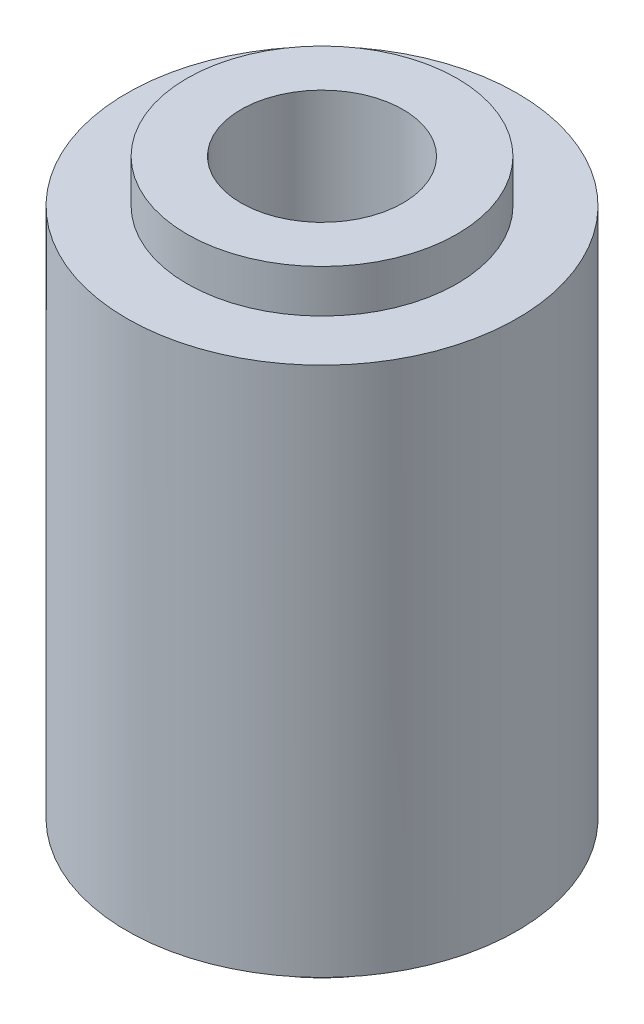
ISO-10303-21;
HEADER;
FILE_DESCRIPTION(('STEP AP214'),'2;1');
FILE_NAME('part.step','',(''),(''),'','','');
FILE_SCHEMA(('AUTOMOTIVE_DESIGN { 1 0 10303 214 1 1 1 1 }'));
ENDSEC;
DATA;
#1=APPLICATION_CONTEXT('core data for automotive mechanical design processes');
#2=APPLICATION_PROTOCOL_DEFINITION('international standard','automotive_design',2000,#1);
#3=PRODUCT_CONTEXT('',#1,'mechanical');
#4=PRODUCT('Part','Part','',(#3));
#5=PRODUCT_RELATED_PRODUCT_CATEGORY('part','',(#4));
#6=PRODUCT_DEFINITION_FORMATION('','',#4);
#7=PRODUCT_DEFINITION_CONTEXT('part definition',#1,'design');
#8=PRODUCT_DEFINITION('design','',#6,#7);
#9=PRODUCT_DEFINITION_SHAPE('','',#8);
#10=(LENGTH_UNIT() NAMED_UNIT(*) SI_UNIT(.MILLI.,.METRE.));
#11=(NAMED_UNIT(*) PLANE_ANGLE_UNIT() SI_UNIT($,.RADIAN.));
#12=(NAMED_UNIT(*) SI_UNIT($,.STERADIAN.) SOLID_ANGLE_UNIT());
#13=UNCERTAINTY_MEASURE_WITH_UNIT(LENGTH_MEASURE(1.E-05),#10,'distance_accuracy_value','');
#14=(GEOMETRIC_REPRESENTATION_CONTEXT(3) GLOBAL_UNCERTAINTY_ASSIGNED_CONTEXT((#13)) GLOBAL_UNIT_ASSIGNED_CONTEXT((#10,
#11,#12)) REPRESENTATION_CONTEXT('',''));
#15=CARTESIAN_POINT('',(0.,0.,0.));
#16=DIRECTION('',(0.,0.,1.));
#17=DIRECTION('',(1.,0.,0.));
#18=AXIS2_PLACEMENT_3D('',#15,#16,#17);
#19=CARTESIAN_POINT('',(0.,5.6,0.));
#20=DIRECTION('',(0.,-1.,0.));
#21=DIRECTION('',(0.,0.,-1.));
#22=AXIS2_PLACEMENT_3D('',#19,#20,#21);
#23=CYLINDRICAL_SURFACE('',#22,3.9751);
#24=CARTESIAN_POINT('',(0.,5.4,0.));
#25=DIRECTION('',(0.,1.,0.));
#26=DIRECTION('',(0.,0.,1.));
#27=AXIS2_PLACEMENT_3D('',#24,#25,#26);
#28=CIRCLE('',#27,3.9751);
#29=CARTESIAN_POINT('',(0.,5.4,3.9751));
#30=VERTEX_POINT('',#29);
#31=EDGE_CURVE('E68',#30,#30,#28,.T.);
#32=ORIENTED_EDGE('',*,*,#31,.F.);
#33=EDGE_LOOP('',(#32));
#34=FACE_BOUND('',#33,.T.);
#35=CARTESIAN_POINT('',(0.,-5.4,0.));
#36=DIRECTION('',(0.,-1.,0.));
#37=DIRECTION('',(0.,0.,-1.));
#38=AXIS2_PLACEMENT_3D('',#35,#36,#37);
#39=CIRCLE('',#38,3.9751);
#40=CARTESIAN_POINT('',(0.,-5.4,-3.9751));
#41=VERTEX_POINT('',#40);
#42=EDGE_CURVE('E76',#41,#41,#39,.T.);
#43=ORIENTED_EDGE('',*,*,#42,.F.);
#44=EDGE_LOOP('',(#43));
#45=FACE_BOUND('',#44,.T.);
#46=ADVANCED_FACE('F45',(#34,#45),#23,.T.);
#47=CARTESIAN_POINT('',(0.,-14.728174593052,0.));
#48=DIRECTION('',(0.,1.,0.));
#49=DIRECTION('',(0.,0.,1.));
#50=AXIS2_PLACEMENT_3D('',#47,#48,#49);
#51=CYLINDRICAL_SURFACE('',#50,2.75);
#52=CARTESIAN_POINT('',(0.,-6.275,0.));
#53=DIRECTION('',(0.,1.,0.));
#54=DIRECTION('',(0.,0.,1.));
#55=AXIS2_PLACEMENT_3D('',#52,#53,#54);
#56=CIRCLE('',#55,2.75);
#57=CARTESIAN_POINT('',(0.,-6.275,2.75));
#58=VERTEX_POINT('',#57);
#59=EDGE_CURVE('E52',#58,#58,#56,.F.);
#60=ORIENTED_EDGE('',*,*,#59,.F.);
#61=EDGE_LOOP('',(#60));
#62=FACE_BOUND('',#61,.T.);
#63=CARTESIAN_POINT('',(0.,-5.4,0.));
#64=DIRECTION('',(0.,-1.,0.));
#65=DIRECTION('',(0.,0.,-1.));
#66=AXIS2_PLACEMENT_3D('',#63,#64,#65);
#67=CIRCLE('',#66,2.75);
#68=CARTESIAN_POINT('',(0.,-5.4,-2.75));
#69=VERTEX_POINT('',#68);
#70=EDGE_CURVE('E80',#69,#69,#67,.T.);
#71=ORIENTED_EDGE('',*,*,#70,.T.);
#72=EDGE_LOOP('',(#71));
#73=FACE_BOUND('',#72,.T.);
#74=ADVANCED_FACE('F85',(#62,#73),#51,.T.);
#75=CARTESIAN_POINT('',(0.,-6.275,0.));
#76=DIRECTION('',(0.,1.,0.));
#77=DIRECTION('',(0.,0.,1.));
#78=AXIS2_PLACEMENT_3D('',#75,#76,#77);
#79=PLANE('',#78);
#80=ORIENTED_EDGE('',*,*,#59,.T.);
#81=EDGE_LOOP('',(#80));
#82=FACE_BOUND('',#81,.T.);
#83=CARTESIAN_POINT('',(0.,-6.275,0.));
#84=DIRECTION('',(0.,1.,0.));
#85=DIRECTION('',(0.,0.,1.));
#86=AXIS2_PLACEMENT_3D('',#83,#84,#85);
#87=CIRCLE('',#86,1.65);
#88=CARTESIAN_POINT('',(0.,-6.275,1.65));
#89=VERTEX_POINT('',#88);
#90=EDGE_CURVE('E11',#89,#89,#87,.F.);
#91=ORIENTED_EDGE('',*,*,#90,.F.);
#92=EDGE_LOOP('',(#91));
#93=FACE_BOUND('',#92,.T.);
#94=ADVANCED_FACE('F100',(#82,#93),#79,.F.);
#95=CARTESIAN_POINT('',(0.,5.6,0.));
#96=DIRECTION('',(0.,1.,0.));
#97=DIRECTION('',(0.,0.,1.));
#98=AXIS2_PLACEMENT_3D('',#95,#96,#97);
#99=CYLINDRICAL_SURFACE('',#98,1.65);
#100=ORIENTED_EDGE('',*,*,#90,.T.);
#101=EDGE_LOOP('',(#100));
#102=FACE_BOUND('',#101,.T.);
#103=CARTESIAN_POINT('',(0.,6.275,0.));
#104=DIRECTION('',(0.,1.,0.));
#105=DIRECTION('',(0.,0.,1.));
#106=AXIS2_PLACEMENT_3D('',#103,#104,#105);
#107=CIRCLE('',#106,1.65);
#108=CARTESIAN_POINT('',(0.,6.275,1.65));
#109=VERTEX_POINT('',#108);
#110=EDGE_CURVE('E62',#109,#109,#107,.T.);
#111=ORIENTED_EDGE('',*,*,#110,.T.);
#112=EDGE_LOOP('',(#111));
#113=FACE_BOUND('',#112,.T.);
#114=ADVANCED_FACE('F118',(#102,#113),#99,.F.);
#115=CARTESIAN_POINT('',(0.,6.275,0.));
#116=DIRECTION('',(0.,1.,0.));
#117=DIRECTION('',(0.,0.,1.));
#118=AXIS2_PLACEMENT_3D('',#115,#116,#117);
#119=CIRCLE('',#118,2.75);
#120=CARTESIAN_POINT('',(0.,6.275,2.75));
#121=VERTEX_POINT('',#120);
#122=EDGE_CURVE('E57',#121,#121,#119,.T.);
#123=ORIENTED_EDGE('',*,*,#122,.F.);
#124=EDGE_LOOP('',(#123));
#125=FACE_BOUND('',#124,.T.);
#126=CARTESIAN_POINT('',(0.,5.4,0.));
#127=DIRECTION('',(0.,1.,0.));
#128=DIRECTION('',(0.,0.,1.));
#129=AXIS2_PLACEMENT_3D('',#126,#127,#128);
#130=CIRCLE('',#129,2.75);
#131=CARTESIAN_POINT('',(0.,5.4,2.75));
#132=VERTEX_POINT('',#131);
#133=EDGE_CURVE('E72',#132,#132,#130,.T.);
#134=ORIENTED_EDGE('',*,*,#133,.T.);
#135=EDGE_LOOP('',(#134));
#136=FACE_BOUND('',#135,.T.);
#137=ADVANCED_FACE('F103',(#125,#136),#51,.T.);
#138=CARTESIAN_POINT('',(0.,6.275,0.));
#139=DIRECTION('',(0.,1.,0.));
#140=DIRECTION('',(0.,0.,1.));
#141=AXIS2_PLACEMENT_3D('',#138,#139,#140);
#142=PLANE('',#141);
#143=ORIENTED_EDGE('',*,*,#122,.T.);
#144=EDGE_LOOP('',(#143));
#145=FACE_BOUND('',#144,.T.);
#146=ORIENTED_EDGE('',*,*,#110,.F.);
#147=EDGE_LOOP('',(#146));
#148=FACE_BOUND('',#147,.T.);
#149=ADVANCED_FACE('F106',(#145,#148),#142,.T.);
#150=CARTESIAN_POINT('',(0.,5.4,0.));
#151=DIRECTION('',(0.,1.,0.));
#152=DIRECTION('',(0.,0.,1.));
#153=AXIS2_PLACEMENT_3D('',#150,#151,#152);
#154=PLANE('',#153);
#155=ORIENTED_EDGE('',*,*,#133,.F.);
#156=EDGE_LOOP('',(#155));
#157=FACE_BOUND('',#156,.T.);
#158=ORIENTED_EDGE('',*,*,#31,.T.);
#159=EDGE_LOOP('',(#158));
#160=FACE_BOUND('',#159,.T.);
#161=ADVANCED_FACE('F90',(#157,#160),#154,.T.);
#162=CARTESIAN_POINT('',(0.,-5.4,0.));
#163=DIRECTION('',(0.,-1.,0.));
#164=DIRECTION('',(0.,0.,-1.));
#165=AXIS2_PLACEMENT_3D('',#162,#163,#164);
#166=PLANE('',#165);
#167=ORIENTED_EDGE('',*,*,#70,.F.);
#168=EDGE_LOOP('',(#167));
#169=FACE_BOUND('',#168,.T.);
#170=ORIENTED_EDGE('',*,*,#42,.T.);
#171=EDGE_LOOP('',(#170));
#172=FACE_BOUND('',#171,.T.);
#173=ADVANCED_FACE('F87',(#169,#172),#166,.T.);
#174=CLOSED_SHELL('',(#46,#74,#94,#114,#137,#149,#161,#173));
#175=MANIFOLD_SOLID_BREP('B2',#174);
#176=ADVANCED_BREP_SHAPE_REPRESENTATION('',(#18,#175),#14);
#177=SHAPE_DEFINITION_REPRESENTATION(#9,#176);
ENDSEC;
END-ISO-10303-21;
